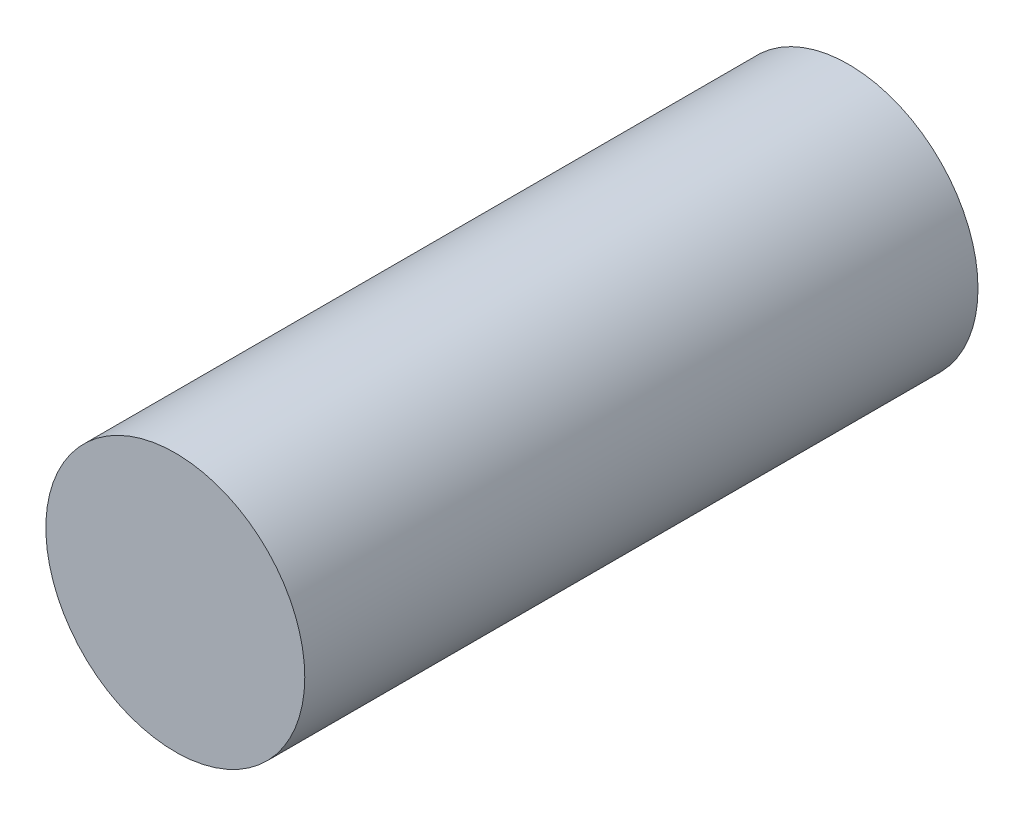
ISO-10303-21;
HEADER;
FILE_DESCRIPTION(('STEP AP214'),'2;1');
FILE_NAME('part.step','',(''),(''),'','','');
FILE_SCHEMA(('AUTOMOTIVE_DESIGN { 1 0 10303 214 1 1 1 1 }'));
ENDSEC;
DATA;
#1=APPLICATION_CONTEXT('core data for automotive mechanical design processes');
#2=APPLICATION_PROTOCOL_DEFINITION('international standard','automotive_design',2000,#1);
#3=PRODUCT_CONTEXT('',#1,'mechanical');
#4=PRODUCT('Part','Part','',(#3));
#5=PRODUCT_RELATED_PRODUCT_CATEGORY('part','',(#4));
#6=PRODUCT_DEFINITION_FORMATION('','',#4);
#7=PRODUCT_DEFINITION_CONTEXT('part definition',#1,'design');
#8=PRODUCT_DEFINITION('design','',#6,#7);
#9=PRODUCT_DEFINITION_SHAPE('','',#8);
#10=(LENGTH_UNIT() NAMED_UNIT(*) SI_UNIT(.MILLI.,.METRE.));
#11=(NAMED_UNIT(*) PLANE_ANGLE_UNIT() SI_UNIT($,.RADIAN.));
#12=(NAMED_UNIT(*) SI_UNIT($,.STERADIAN.) SOLID_ANGLE_UNIT());
#13=UNCERTAINTY_MEASURE_WITH_UNIT(LENGTH_MEASURE(1.E-05),#10,'distance_accuracy_value','');
#14=(GEOMETRIC_REPRESENTATION_CONTEXT(3) GLOBAL_UNCERTAINTY_ASSIGNED_CONTEXT((#13)) GLOBAL_UNIT_ASSIGNED_CONTEXT((#10,
#11,#12)) REPRESENTATION_CONTEXT('',''));
#15=CARTESIAN_POINT('',(0.,0.,0.));
#16=DIRECTION('',(0.,0.,1.));
#17=DIRECTION('',(1.,0.,0.));
#18=AXIS2_PLACEMENT_3D('',#15,#16,#17);
#19=CARTESIAN_POINT('',(0.,0.,13.));
#20=DIRECTION('',(0.,0.,-1.));
#21=DIRECTION('',(-1.,0.,0.));
#22=AXIS2_PLACEMENT_3D('',#19,#20,#21);
#23=CYLINDRICAL_SURFACE('',#22,2.5);
#24=CARTESIAN_POINT('',(0.,0.,13.));
#25=DIRECTION('',(0.,0.,1.));
#26=DIRECTION('',(1.,0.,0.));
#27=AXIS2_PLACEMENT_3D('',#24,#25,#26);
#28=CIRCLE('',#27,2.5);
#29=CARTESIAN_POINT('',(2.5,0.,13.));
#30=VERTEX_POINT('',#29);
#31=EDGE_CURVE('E10',#30,#30,#28,.T.);
#32=ORIENTED_EDGE('',*,*,#31,.F.);
#33=EDGE_LOOP('',(#32));
#34=FACE_BOUND('',#33,.T.);
#35=CARTESIAN_POINT('',(0.,0.,0.));
#36=DIRECTION('',(0.,0.,1.));
#37=DIRECTION('',(1.,0.,0.));
#38=AXIS2_PLACEMENT_3D('',#35,#36,#37);
#39=CIRCLE('',#38,2.5);
#40=CARTESIAN_POINT('',(2.5,0.,0.));
#41=VERTEX_POINT('',#40);
#42=EDGE_CURVE('E34',#41,#41,#39,.T.);
#43=ORIENTED_EDGE('',*,*,#42,.T.);
#44=EDGE_LOOP('',(#43));
#45=FACE_BOUND('',#44,.T.);
#46=ADVANCED_FACE('F31',(#34,#45),#23,.T.);
#47=CARTESIAN_POINT('',(0.,0.,13.));
#48=DIRECTION('',(0.,0.,1.));
#49=DIRECTION('',(1.,0.,0.));
#50=AXIS2_PLACEMENT_3D('',#47,#48,#49);
#51=PLANE('',#50);
#52=ORIENTED_EDGE('',*,*,#31,.T.);
#53=EDGE_LOOP('',(#52));
#54=FACE_BOUND('',#53,.T.);
#55=ADVANCED_FACE('F46',(#54),#51,.T.);
#56=CARTESIAN_POINT('',(0.,0.,0.));
#57=DIRECTION('',(0.,0.,1.));
#58=DIRECTION('',(1.,0.,0.));
#59=AXIS2_PLACEMENT_3D('',#56,#57,#58);
#60=PLANE('',#59);
#61=ORIENTED_EDGE('',*,*,#42,.F.);
#62=EDGE_LOOP('',(#61));
#63=FACE_BOUND('',#62,.T.);
#64=ADVANCED_FACE('F44',(#63),#60,.F.);
#65=CLOSED_SHELL('',(#46,#55,#64));
#66=MANIFOLD_SOLID_BREP('B2',#65);
#67=ADVANCED_BREP_SHAPE_REPRESENTATION('',(#18,#66),#14);
#68=SHAPE_DEFINITION_REPRESENTATION(#9,#67);
ENDSEC;
END-ISO-10303-21;
